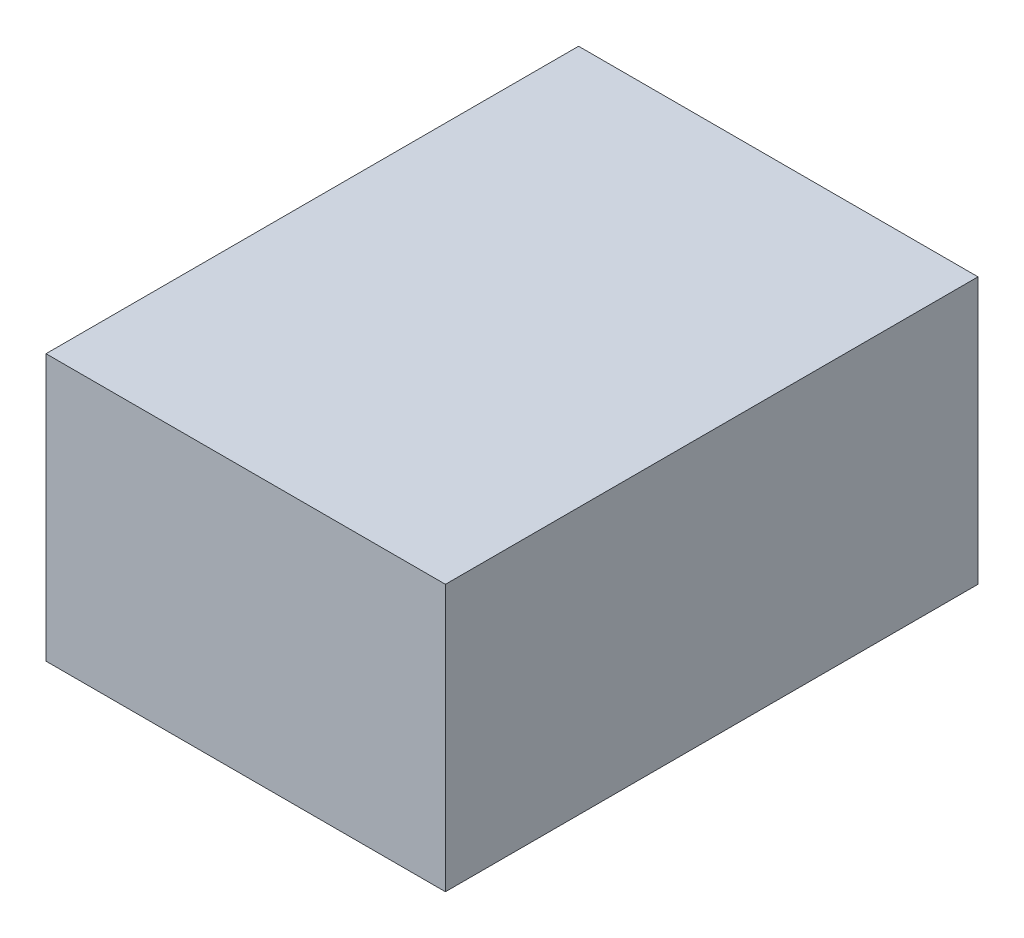
ISO-10303-21;
HEADER;
FILE_DESCRIPTION(('STEP AP214'),'2;1');
FILE_NAME('part.step','',(''),(''),'','','');
FILE_SCHEMA(('AUTOMOTIVE_DESIGN { 1 0 10303 214 1 1 1 1 }'));
ENDSEC;
DATA;
#1=APPLICATION_CONTEXT('core data for automotive mechanical design processes');
#2=APPLICATION_PROTOCOL_DEFINITION('international standard','automotive_design',2000,#1);
#3=PRODUCT_CONTEXT('',#1,'mechanical');
#4=PRODUCT('Part','Part','',(#3));
#5=PRODUCT_RELATED_PRODUCT_CATEGORY('part','',(#4));
#6=PRODUCT_DEFINITION_FORMATION('','',#4);
#7=PRODUCT_DEFINITION_CONTEXT('part definition',#1,'design');
#8=PRODUCT_DEFINITION('design','',#6,#7);
#9=PRODUCT_DEFINITION_SHAPE('','',#8);
#10=(LENGTH_UNIT() NAMED_UNIT(*) SI_UNIT(.MILLI.,.METRE.));
#11=(NAMED_UNIT(*) PLANE_ANGLE_UNIT() SI_UNIT($,.RADIAN.));
#12=(NAMED_UNIT(*) SI_UNIT($,.STERADIAN.) SOLID_ANGLE_UNIT());
#13=UNCERTAINTY_MEASURE_WITH_UNIT(LENGTH_MEASURE(1.E-05),#10,'distance_accuracy_value','');
#14=(GEOMETRIC_REPRESENTATION_CONTEXT(3) GLOBAL_UNCERTAINTY_ASSIGNED_CONTEXT((#13)) GLOBAL_UNIT_ASSIGNED_CONTEXT((#10,
#11,#12)) REPRESENTATION_CONTEXT('',''));
#15=CARTESIAN_POINT('',(0.,0.,0.));
#16=DIRECTION('',(0.,0.,1.));
#17=DIRECTION('',(1.,0.,0.));
#18=AXIS2_PLACEMENT_3D('',#15,#16,#17);
#19=CARTESIAN_POINT('',(3.,-2.,8.));
#20=DIRECTION('',(-1.,0.,0.));
#21=DIRECTION('',(0.,0.,1.));
#22=AXIS2_PLACEMENT_3D('',#19,#20,#21);
#23=PLANE('',#22);
#24=DIRECTION('',(0.,1.,0.));
#25=VECTOR('',#24,1.);
#26=CARTESIAN_POINT('',(3.,-2.,0.));
#27=LINE('',#26,#25);
#28=CARTESIAN_POINT('',(3.,-2.,0.));
#29=VERTEX_POINT('',#28);
#30=CARTESIAN_POINT('',(3.,2.,0.));
#31=VERTEX_POINT('',#30);
#32=EDGE_CURVE('E96',#29,#31,#27,.T.);
#33=ORIENTED_EDGE('',*,*,#32,.T.);
#34=DIRECTION('',(0.,0.,-1.));
#35=VECTOR('',#34,1.);
#36=CARTESIAN_POINT('',(3.,2.,8.));
#37=LINE('',#36,#35);
#38=CARTESIAN_POINT('',(3.,2.,8.));
#39=VERTEX_POINT('',#38);
#40=EDGE_CURVE('E11',#39,#31,#37,.T.);
#41=ORIENTED_EDGE('',*,*,#40,.F.);
#42=DIRECTION('',(0.,1.,0.));
#43=VECTOR('',#42,1.);
#44=CARTESIAN_POINT('',(3.,-2.,8.));
#45=LINE('',#44,#43);
#46=CARTESIAN_POINT('',(3.,-2.,8.));
#47=VERTEX_POINT('',#46);
#48=EDGE_CURVE('E84',#47,#39,#45,.T.);
#49=ORIENTED_EDGE('',*,*,#48,.F.);
#50=DIRECTION('',(0.,0.,-1.));
#51=VECTOR('',#50,1.);
#52=CARTESIAN_POINT('',(3.,-2.,8.));
#53=LINE('',#52,#51);
#54=EDGE_CURVE('E92',#47,#29,#53,.T.);
#55=ORIENTED_EDGE('',*,*,#54,.T.);
#56=EDGE_LOOP('',(#33,#41,#49,#55));
#57=FACE_BOUND('',#56,.T.);
#58=ADVANCED_FACE('F33',(#57),#23,.F.);
#59=CARTESIAN_POINT('',(-3.,2.,8.));
#60=DIRECTION('',(0.,-1.,0.));
#61=DIRECTION('',(0.,0.,-1.));
#62=AXIS2_PLACEMENT_3D('',#59,#60,#61);
#63=PLANE('',#62);
#64=DIRECTION('',(-1.,0.,0.));
#65=VECTOR('',#64,1.);
#66=CARTESIAN_POINT('',(-3.,2.,0.));
#67=LINE('',#66,#65);
#68=CARTESIAN_POINT('',(-3.,2.,0.));
#69=VERTEX_POINT('',#68);
#70=EDGE_CURVE('E88',#31,#69,#67,.T.);
#71=ORIENTED_EDGE('',*,*,#70,.T.);
#72=DIRECTION('',(0.,0.,-1.));
#73=VECTOR('',#72,1.);
#74=CARTESIAN_POINT('',(-3.,2.,8.));
#75=LINE('',#74,#73);
#76=CARTESIAN_POINT('',(-3.,2.,8.));
#77=VERTEX_POINT('',#76);
#78=EDGE_CURVE('E41',#77,#69,#75,.T.);
#79=ORIENTED_EDGE('',*,*,#78,.F.);
#80=DIRECTION('',(-1.,0.,0.));
#81=VECTOR('',#80,1.);
#82=CARTESIAN_POINT('',(-3.,2.,8.));
#83=LINE('',#82,#81);
#84=EDGE_CURVE('E79',#39,#77,#83,.T.);
#85=ORIENTED_EDGE('',*,*,#84,.F.);
#86=ORIENTED_EDGE('',*,*,#40,.T.);
#87=EDGE_LOOP('',(#71,#79,#85,#86));
#88=FACE_BOUND('',#87,.T.);
#89=ADVANCED_FACE('F87',(#88),#63,.F.);
#90=CARTESIAN_POINT('',(-3.,-2.,8.));
#91=DIRECTION('',(1.,0.,0.));
#92=DIRECTION('',(0.,0.,-1.));
#93=AXIS2_PLACEMENT_3D('',#90,#91,#92);
#94=PLANE('',#93);
#95=DIRECTION('',(0.,-1.,0.));
#96=VECTOR('',#95,1.);
#97=CARTESIAN_POINT('',(-3.,-2.,0.));
#98=LINE('',#97,#96);
#99=CARTESIAN_POINT('',(-3.,-2.,0.));
#100=VERTEX_POINT('',#99);
#101=EDGE_CURVE('E66',#69,#100,#98,.T.);
#102=ORIENTED_EDGE('',*,*,#101,.T.);
#103=DIRECTION('',(0.,0.,-1.));
#104=VECTOR('',#103,1.);
#105=CARTESIAN_POINT('',(-3.,-2.,8.));
#106=LINE('',#105,#104);
#107=CARTESIAN_POINT('',(-3.,-2.,8.));
#108=VERTEX_POINT('',#107);
#109=EDGE_CURVE('E89',#108,#100,#106,.T.);
#110=ORIENTED_EDGE('',*,*,#109,.F.);
#111=DIRECTION('',(0.,-1.,0.));
#112=VECTOR('',#111,1.);
#113=CARTESIAN_POINT('',(-3.,-2.,8.));
#114=LINE('',#113,#112);
#115=EDGE_CURVE('E82',#77,#108,#114,.T.);
#116=ORIENTED_EDGE('',*,*,#115,.F.);
#117=ORIENTED_EDGE('',*,*,#78,.T.);
#118=EDGE_LOOP('',(#102,#110,#116,#117));
#119=FACE_BOUND('',#118,.T.);
#120=ADVANCED_FACE('F90',(#119),#94,.F.);
#121=CARTESIAN_POINT('',(-3.,-2.,8.));
#122=DIRECTION('',(0.,1.,0.));
#123=DIRECTION('',(0.,0.,1.));
#124=AXIS2_PLACEMENT_3D('',#121,#122,#123);
#125=PLANE('',#124);
#126=DIRECTION('',(1.,0.,0.));
#127=VECTOR('',#126,1.);
#128=CARTESIAN_POINT('',(-3.,-2.,0.));
#129=LINE('',#128,#127);
#130=EDGE_CURVE('E72',#100,#29,#129,.T.);
#131=ORIENTED_EDGE('',*,*,#130,.T.);
#132=ORIENTED_EDGE('',*,*,#54,.F.);
#133=DIRECTION('',(1.,0.,0.));
#134=VECTOR('',#133,1.);
#135=CARTESIAN_POINT('',(-3.,-2.,8.));
#136=LINE('',#135,#134);
#137=EDGE_CURVE('E49',#108,#47,#136,.T.);
#138=ORIENTED_EDGE('',*,*,#137,.F.);
#139=ORIENTED_EDGE('',*,*,#109,.T.);
#140=EDGE_LOOP('',(#131,#132,#138,#139));
#141=FACE_BOUND('',#140,.T.);
#142=ADVANCED_FACE('F103',(#141),#125,.F.);
#143=CARTESIAN_POINT('',(0.,0.,8.));
#144=DIRECTION('',(0.,0.,-1.));
#145=DIRECTION('',(-1.,0.,0.));
#146=AXIS2_PLACEMENT_3D('',#143,#144,#145);
#147=PLANE('',#146);
#148=ORIENTED_EDGE('',*,*,#48,.T.);
#149=ORIENTED_EDGE('',*,*,#84,.T.);
#150=ORIENTED_EDGE('',*,*,#115,.T.);
#151=ORIENTED_EDGE('',*,*,#137,.T.);
#152=EDGE_LOOP('',(#148,#149,#150,#151));
#153=FACE_BOUND('',#152,.T.);
#154=ADVANCED_FACE('F80',(#153),#147,.F.);
#155=CARTESIAN_POINT('',(0.,0.,0.));
#156=DIRECTION('',(0.,0.,-1.));
#157=DIRECTION('',(-1.,0.,0.));
#158=AXIS2_PLACEMENT_3D('',#155,#156,#157);
#159=PLANE('',#158);
#160=ORIENTED_EDGE('',*,*,#32,.F.);
#161=ORIENTED_EDGE('',*,*,#130,.F.);
#162=ORIENTED_EDGE('',*,*,#101,.F.);
#163=ORIENTED_EDGE('',*,*,#70,.F.);
#164=EDGE_LOOP('',(#160,#161,#162,#163));
#165=FACE_BOUND('',#164,.T.);
#166=ADVANCED_FACE('F106',(#165),#159,.T.);
#167=CLOSED_SHELL('',(#58,#89,#120,#142,#154,#166));
#168=MANIFOLD_SOLID_BREP('B2',#167);
#169=ADVANCED_BREP_SHAPE_REPRESENTATION('',(#18,#168),#14);
#170=SHAPE_DEFINITION_REPRESENTATION(#9,#169);
ENDSEC;
END-ISO-10303-21;
